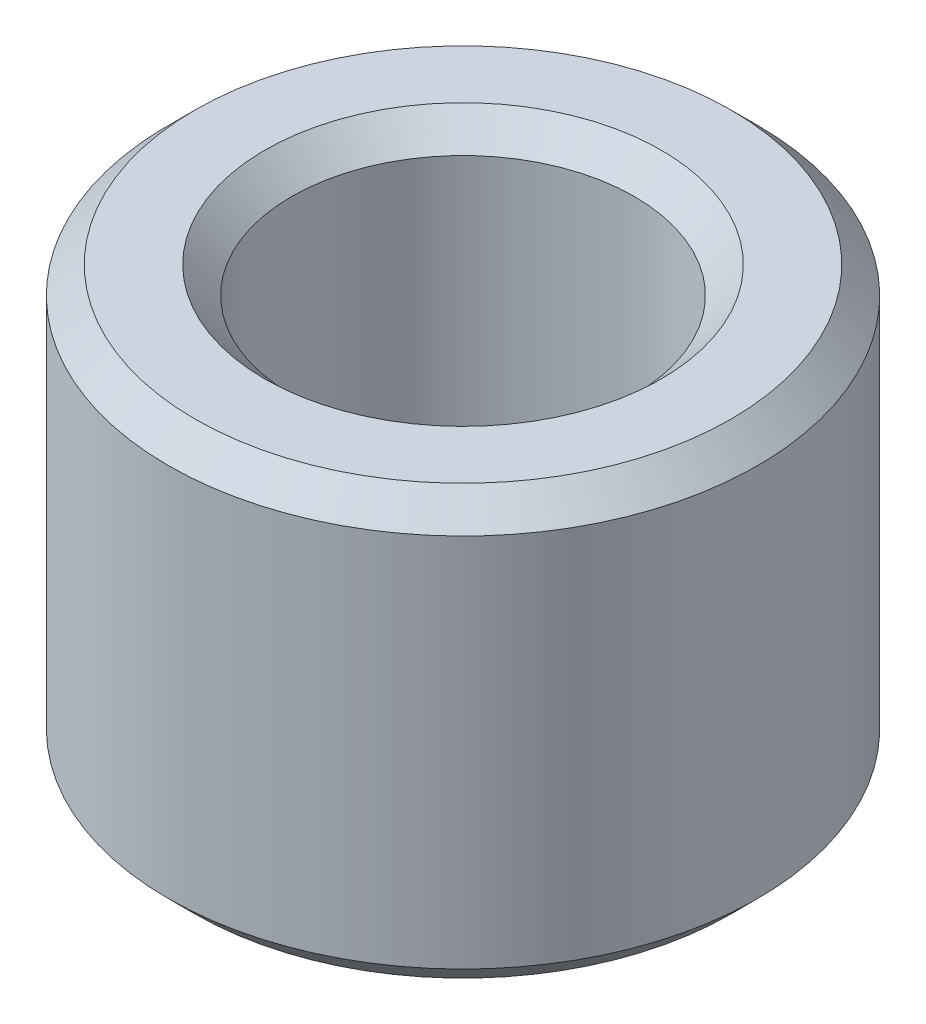
ISO-10303-21;
HEADER;
FILE_DESCRIPTION(('STEP AP214'),'2;1');
FILE_NAME('part.step','',(''),(''),'','','');
FILE_SCHEMA(('AUTOMOTIVE_DESIGN { 1 0 10303 214 1 1 1 1 }'));
ENDSEC;
DATA;
#1=APPLICATION_CONTEXT('core data for automotive mechanical design processes');
#2=APPLICATION_PROTOCOL_DEFINITION('international standard','automotive_design',2000,#1);
#3=PRODUCT_CONTEXT('',#1,'mechanical');
#4=PRODUCT('Part','Part','',(#3));
#5=PRODUCT_RELATED_PRODUCT_CATEGORY('part','',(#4));
#6=PRODUCT_DEFINITION_FORMATION('','',#4);
#7=PRODUCT_DEFINITION_CONTEXT('part definition',#1,'design');
#8=PRODUCT_DEFINITION('design','',#6,#7);
#9=PRODUCT_DEFINITION_SHAPE('','',#8);
#10=(LENGTH_UNIT() NAMED_UNIT(*) SI_UNIT(.MILLI.,.METRE.));
#11=(NAMED_UNIT(*) PLANE_ANGLE_UNIT() SI_UNIT($,.RADIAN.));
#12=(NAMED_UNIT(*) SI_UNIT($,.STERADIAN.) SOLID_ANGLE_UNIT());
#13=UNCERTAINTY_MEASURE_WITH_UNIT(LENGTH_MEASURE(1.E-05),#10,'distance_accuracy_value','');
#14=(GEOMETRIC_REPRESENTATION_CONTEXT(3) GLOBAL_UNCERTAINTY_ASSIGNED_CONTEXT((#13)) GLOBAL_UNIT_ASSIGNED_CONTEXT((#10,
#11,#12)) REPRESENTATION_CONTEXT('',''));
#15=CARTESIAN_POINT('',(0.,0.,0.));
#16=DIRECTION('',(0.,0.,1.));
#17=DIRECTION('',(1.,0.,0.));
#18=AXIS2_PLACEMENT_3D('',#15,#16,#17);
#19=CARTESIAN_POINT('',(0.,0.,0.));
#20=DIRECTION('',(0.,1.,0.));
#21=DIRECTION('',(0.,0.,1.));
#22=AXIS2_PLACEMENT_3D('',#19,#20,#21);
#23=CYLINDRICAL_SURFACE('',#22,1.6);
#24=CARTESIAN_POINT('',(0.,0.249999999994088,0.));
#25=DIRECTION('',(0.,-1.,0.));
#26=DIRECTION('',(1.,0.,0.));
#27=AXIS2_PLACEMENT_3D('',#24,#25,#26);
#28=CIRCLE('',#27,1.59999999999627);
#29=CARTESIAN_POINT('',(1.59999999999627,0.249999999994088,0.));
#30=VERTEX_POINT('',#29);
#31=EDGE_CURVE('E30',#30,#30,#28,.T.);
#32=ORIENTED_EDGE('',*,*,#31,.T.);
#33=EDGE_LOOP('',(#32));
#34=FACE_BOUND('',#33,.T.);
#35=CARTESIAN_POINT('',(0.,3.74999999996817,0.));
#36=DIRECTION('',(0.,1.,0.));
#37=DIRECTION('',(1.,0.,0.));
#38=AXIS2_PLACEMENT_3D('',#35,#36,#37);
#39=CIRCLE('',#38,1.60000000005311);
#40=CARTESIAN_POINT('',(1.60000000005311,3.74999999996817,0.));
#41=VERTEX_POINT('',#40);
#42=EDGE_CURVE('E33',#41,#41,#39,.T.);
#43=ORIENTED_EDGE('',*,*,#42,.T.);
#44=EDGE_LOOP('',(#43));
#45=FACE_BOUND('',#44,.T.);
#46=ADVANCED_FACE('F15',(#34,#45),#23,.F.);
#47=CARTESIAN_POINT('',(0.,3.99999999990541,0.));
#48=DIRECTION('',(0.,1.,0.));
#49=DIRECTION('',(0.,0.,1.));
#50=AXIS2_PLACEMENT_3D('',#47,#48,#49);
#51=CONICAL_SURFACE('',#50,1.84999999993352,0.785398163397448);
#52=ORIENTED_EDGE('',*,*,#42,.F.);
#53=EDGE_LOOP('',(#52));
#54=FACE_BOUND('',#53,.T.);
#55=CARTESIAN_POINT('',(0.,4.0000000000191,0.));
#56=DIRECTION('',(0.,1.,0.));
#57=DIRECTION('',(0.,0.,1.));
#58=AXIS2_PLACEMENT_3D('',#55,#56,#57);
#59=CIRCLE('',#58,1.8500000000472);
#60=CARTESIAN_POINT('',(0.,4.0000000000191,1.8500000000472));
#61=VERTEX_POINT('',#60);
#62=EDGE_CURVE('E18',#61,#61,#59,.F.);
#63=ORIENTED_EDGE('',*,*,#62,.F.);
#64=EDGE_LOOP('',(#63));
#65=FACE_BOUND('',#64,.T.);
#66=ADVANCED_FACE('F50',(#54,#65),#51,.F.);
#67=CARTESIAN_POINT('',(0.,1.13686837721616E-10,0.));
#68=DIRECTION('',(0.,-1.,0.));
#69=DIRECTION('',(0.,0.,-1.));
#70=AXIS2_PLACEMENT_3D('',#67,#68,#69);
#71=CONICAL_SURFACE('',#70,1.84999999993352,0.785398163511135);
#72=CARTESIAN_POINT('',(0.,5.68434188737327E-11,0.));
#73=DIRECTION('',(0.,-1.,0.));
#74=DIRECTION('',(0.,0.,-1.));
#75=AXIS2_PLACEMENT_3D('',#72,#73,#74);
#76=CIRCLE('',#75,1.84999999999036);
#77=CARTESIAN_POINT('',(0.,5.68434188737327E-11,-1.84999999999036));
#78=VERTEX_POINT('',#77);
#79=EDGE_CURVE('E40',#78,#78,#76,.T.);
#80=ORIENTED_EDGE('',*,*,#79,.T.);
#81=EDGE_LOOP('',(#80));
#82=FACE_BOUND('',#81,.T.);
#83=ORIENTED_EDGE('',*,*,#31,.F.);
#84=EDGE_LOOP('',(#83));
#85=FACE_BOUND('',#84,.T.);
#86=ADVANCED_FACE('F52',(#82,#85),#71,.F.);
#87=CARTESIAN_POINT('',(0.,4.,0.));
#88=DIRECTION('',(0.,1.,0.));
#89=DIRECTION('',(0.,0.,1.));
#90=AXIS2_PLACEMENT_3D('',#87,#88,#89);
#91=PLANE('',#90);
#92=ORIENTED_EDGE('',*,*,#62,.T.);
#93=EDGE_LOOP('',(#92));
#94=FACE_BOUND('',#93,.T.);
#95=CARTESIAN_POINT('',(0.,4.0000000000191,0.));
#96=DIRECTION('',(0.,-1.,0.));
#97=DIRECTION('',(0.,0.,-1.));
#98=AXIS2_PLACEMENT_3D('',#95,#96,#97);
#99=CIRCLE('',#98,2.49999999999773);
#100=CARTESIAN_POINT('',(0.,4.0000000000191,-2.49999999999773));
#101=VERTEX_POINT('',#100);
#102=EDGE_CURVE('E38',#101,#101,#99,.T.);
#103=ORIENTED_EDGE('',*,*,#102,.F.);
#104=EDGE_LOOP('',(#103));
#105=FACE_BOUND('',#104,.T.);
#106=ADVANCED_FACE('F47',(#94,#105),#91,.T.);
#107=CARTESIAN_POINT('',(0.,0.,0.));
#108=DIRECTION('',(0.,1.,0.));
#109=DIRECTION('',(0.,0.,1.));
#110=AXIS2_PLACEMENT_3D('',#107,#108,#109);
#111=PLANE('',#110);
#112=ORIENTED_EDGE('',*,*,#79,.F.);
#113=EDGE_LOOP('',(#112));
#114=FACE_BOUND('',#113,.T.);
#115=CARTESIAN_POINT('',(0.,0.,0.));
#116=DIRECTION('',(0.,1.,0.));
#117=DIRECTION('',(0.,0.,1.));
#118=AXIS2_PLACEMENT_3D('',#115,#116,#117);
#119=CIRCLE('',#118,2.49999999999773);
#120=CARTESIAN_POINT('',(0.,0.,2.49999999999773));
#121=VERTEX_POINT('',#120);
#122=EDGE_CURVE('E27',#121,#121,#119,.T.);
#123=ORIENTED_EDGE('',*,*,#122,.F.);
#124=EDGE_LOOP('',(#123));
#125=FACE_BOUND('',#124,.T.);
#126=ADVANCED_FACE('F76',(#114,#125),#111,.F.);
#127=CARTESIAN_POINT('',(0.,3.75000000002501,0.));
#128=DIRECTION('',(0.,-1.,0.));
#129=DIRECTION('',(0.,0.,-1.));
#130=AXIS2_PLACEMENT_3D('',#127,#128,#129);
#131=CONICAL_SURFACE('',#130,2.74999999999181,0.785398163397448);
#132=CARTESIAN_POINT('',(0.,3.75,0.));
#133=DIRECTION('',(0.,1.,0.));
#134=DIRECTION('',(0.,0.,1.));
#135=AXIS2_PLACEMENT_3D('',#132,#133,#134);
#136=CIRCLE('',#135,2.75);
#137=CARTESIAN_POINT('',(0.,3.75,2.75));
#138=VERTEX_POINT('',#137);
#139=EDGE_CURVE('E22',#138,#138,#136,.F.);
#140=ORIENTED_EDGE('',*,*,#139,.F.);
#141=EDGE_LOOP('',(#140));
#142=FACE_BOUND('',#141,.T.);
#143=ORIENTED_EDGE('',*,*,#102,.T.);
#144=EDGE_LOOP('',(#143));
#145=FACE_BOUND('',#144,.T.);
#146=ADVANCED_FACE('F69',(#142,#145),#131,.T.);
#147=CARTESIAN_POINT('',(0.,0.249999999880401,0.));
#148=DIRECTION('',(0.,1.,0.));
#149=DIRECTION('',(0.,0.,1.));
#150=AXIS2_PLACEMENT_3D('',#147,#148,#149);
#151=CONICAL_SURFACE('',#150,2.74999999987813,0.785398163397448);
#152=ORIENTED_EDGE('',*,*,#122,.T.);
#153=EDGE_LOOP('',(#152));
#154=FACE_BOUND('',#153,.T.);
#155=CARTESIAN_POINT('',(0.,0.25,0.));
#156=DIRECTION('',(0.,1.,0.));
#157=DIRECTION('',(0.,0.,1.));
#158=AXIS2_PLACEMENT_3D('',#155,#156,#157);
#159=CIRCLE('',#158,2.75);
#160=CARTESIAN_POINT('',(0.,0.25,2.75));
#161=VERTEX_POINT('',#160);
#162=EDGE_CURVE('E10',#161,#161,#159,.T.);
#163=ORIENTED_EDGE('',*,*,#162,.F.);
#164=EDGE_LOOP('',(#163));
#165=FACE_BOUND('',#164,.T.);
#166=ADVANCED_FACE('F64',(#154,#165),#151,.T.);
#167=CARTESIAN_POINT('',(0.,0.,0.));
#168=DIRECTION('',(0.,1.,0.));
#169=DIRECTION('',(0.,0.,1.));
#170=AXIS2_PLACEMENT_3D('',#167,#168,#169);
#171=CYLINDRICAL_SURFACE('',#170,2.75);
#172=ORIENTED_EDGE('',*,*,#162,.T.);
#173=EDGE_LOOP('',(#172));
#174=FACE_BOUND('',#173,.T.);
#175=ORIENTED_EDGE('',*,*,#139,.T.);
#176=EDGE_LOOP('',(#175));
#177=FACE_BOUND('',#176,.T.);
#178=ADVANCED_FACE('F62',(#174,#177),#171,.T.);
#179=CLOSED_SHELL('',(#46,#66,#86,#106,#126,#146,#166,#178));
#180=MANIFOLD_SOLID_BREP('B1',#179);
#181=ADVANCED_BREP_SHAPE_REPRESENTATION('',(#18,#180),#14);
#182=SHAPE_DEFINITION_REPRESENTATION(#9,#181);
ENDSEC;
END-ISO-10303-21;
